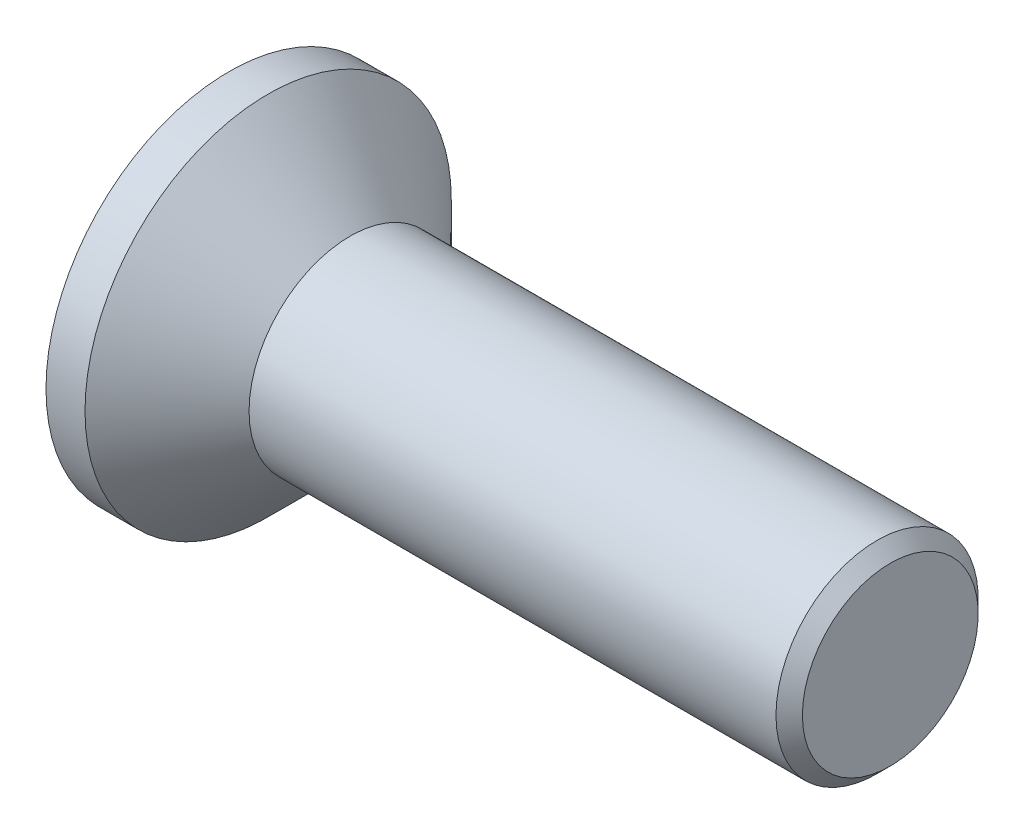
ISO-10303-21;
HEADER;
FILE_DESCRIPTION(('STEP AP214'),'2;1');
FILE_NAME('part.step','',(''),(''),'','','');
FILE_SCHEMA(('AUTOMOTIVE_DESIGN { 1 0 10303 214 1 1 1 1 }'));
ENDSEC;
DATA;
#1=APPLICATION_CONTEXT('core data for automotive mechanical design processes');
#2=APPLICATION_PROTOCOL_DEFINITION('international standard','automotive_design',2000,#1);
#3=PRODUCT_CONTEXT('',#1,'mechanical');
#4=PRODUCT('Part','Part','',(#3));
#5=PRODUCT_RELATED_PRODUCT_CATEGORY('part','',(#4));
#6=PRODUCT_DEFINITION_FORMATION('','',#4);
#7=PRODUCT_DEFINITION_CONTEXT('part definition',#1,'design');
#8=PRODUCT_DEFINITION('design','',#6,#7);
#9=PRODUCT_DEFINITION_SHAPE('','',#8);
#10=(LENGTH_UNIT() NAMED_UNIT(*) SI_UNIT(.MILLI.,.METRE.));
#11=(NAMED_UNIT(*) PLANE_ANGLE_UNIT() SI_UNIT($,.RADIAN.));
#12=(NAMED_UNIT(*) SI_UNIT($,.STERADIAN.) SOLID_ANGLE_UNIT());
#13=UNCERTAINTY_MEASURE_WITH_UNIT(LENGTH_MEASURE(1.E-05),#10,'distance_accuracy_value','');
#14=(GEOMETRIC_REPRESENTATION_CONTEXT(3) GLOBAL_UNCERTAINTY_ASSIGNED_CONTEXT((#13)) GLOBAL_UNIT_ASSIGNED_CONTEXT((#10,
#11,#12)) REPRESENTATION_CONTEXT('',''));
#15=CARTESIAN_POINT('',(0.,0.,0.));
#16=DIRECTION('',(0.,0.,1.));
#17=DIRECTION('',(1.,0.,0.));
#18=AXIS2_PLACEMENT_3D('',#15,#16,#17);
#19=CARTESIAN_POINT('',(1.09999999999999,0.,0.));
#20=DIRECTION('',(-1.,0.,0.));
#21=DIRECTION('',(0.,0.,1.));
#22=AXIS2_PLACEMENT_3D('',#19,#20,#21);
#23=CONICAL_SURFACE('',#22,0.99999999999989,1.04719755119658);
#24=CARTESIAN_POINT('',(1.67735026918958,0.,0.));
#25=VERTEX_POINT('',#24);
#26=VERTEX_LOOP('',#25);
#27=FACE_BOUND('',#26,.T.);
#28=CARTESIAN_POINT('',(1.09999999999999,0.,0.));
#29=DIRECTION('',(-1.,0.,0.));
#30=DIRECTION('',(0.,0.,1.));
#31=AXIS2_PLACEMENT_3D('',#28,#29,#30);
#32=CIRCLE('',#31,0.99999999999989);
#33=CARTESIAN_POINT('',(1.09999999999999,-0.499999999999972,0.86602540378439));
#34=VERTEX_POINT('',#33);
#35=CARTESIAN_POINT('',(1.09999999999999,0.499999999999972,0.866025403784391));
#36=VERTEX_POINT('',#35);
#37=EDGE_CURVE('E92',#34,#36,#32,.T.);
#38=ORIENTED_EDGE('',*,*,#37,.T.);
#39=CARTESIAN_POINT('',(1.09999999999999,0.,0.));
#40=DIRECTION('',(-1.,0.,0.));
#41=DIRECTION('',(0.,0.,1.));
#42=AXIS2_PLACEMENT_3D('',#39,#40,#41);
#43=CIRCLE('',#42,0.99999999999989);
#44=CARTESIAN_POINT('',(1.09999999999999,0.999999999999945,0.));
#45=VERTEX_POINT('',#44);
#46=EDGE_CURVE('E106',#36,#45,#43,.T.);
#47=ORIENTED_EDGE('',*,*,#46,.T.);
#48=CARTESIAN_POINT('',(1.09999999999999,0.,0.));
#49=DIRECTION('',(-1.,0.,0.));
#50=DIRECTION('',(0.,0.,1.));
#51=AXIS2_PLACEMENT_3D('',#48,#49,#50);
#52=CIRCLE('',#51,0.99999999999989);
#53=CARTESIAN_POINT('',(1.09999999999999,0.499999999999972,-0.866025403784391));
#54=VERTEX_POINT('',#53);
#55=EDGE_CURVE('E149',#45,#54,#52,.T.);
#56=ORIENTED_EDGE('',*,*,#55,.T.);
#57=CARTESIAN_POINT('',(1.09999999999999,0.,0.));
#58=DIRECTION('',(-1.,0.,0.));
#59=DIRECTION('',(0.,0.,1.));
#60=AXIS2_PLACEMENT_3D('',#57,#58,#59);
#61=CIRCLE('',#60,0.99999999999989);
#62=CARTESIAN_POINT('',(1.09999999999999,-0.499999999999973,-0.866025403784392));
#63=VERTEX_POINT('',#62);
#64=EDGE_CURVE('E136',#54,#63,#61,.T.);
#65=ORIENTED_EDGE('',*,*,#64,.T.);
#66=CARTESIAN_POINT('',(1.09999999999999,0.,0.));
#67=DIRECTION('',(-1.,0.,0.));
#68=DIRECTION('',(0.,0.,1.));
#69=AXIS2_PLACEMENT_3D('',#66,#67,#68);
#70=CIRCLE('',#69,0.99999999999989);
#71=CARTESIAN_POINT('',(1.09999999999999,-0.999999999999945,0.));
#72=VERTEX_POINT('',#71);
#73=EDGE_CURVE('E89',#63,#72,#70,.T.);
#74=ORIENTED_EDGE('',*,*,#73,.T.);
#75=CARTESIAN_POINT('',(1.09999999999999,0.,0.));
#76=DIRECTION('',(-1.,0.,0.));
#77=DIRECTION('',(0.,0.,1.));
#78=AXIS2_PLACEMENT_3D('',#75,#76,#77);
#79=CIRCLE('',#78,0.99999999999989);
#80=EDGE_CURVE('E20',#72,#34,#79,.T.);
#81=ORIENTED_EDGE('',*,*,#80,.T.);
#82=EDGE_LOOP('',(#38,#47,#56,#65,#74,#81));
#83=FACE_BOUND('',#82,.T.);
#84=ADVANCED_FACE('F17',(#27,#83),#23,.F.);
#85=CARTESIAN_POINT('',(1.1,0.,-1.15470053837925));
#86=DIRECTION('',(1.,0.,0.));
#87=DIRECTION('',(0.,0.,-1.));
#88=AXIS2_PLACEMENT_3D('',#85,#86,#87);
#89=PLANE('',#88);
#90=DIRECTION('',(0.,0.,1.));
#91=VECTOR('',#90,1.);
#92=CARTESIAN_POINT('',(1.1,-1.,0.577350269189625));
#93=LINE('',#92,#91);
#94=CARTESIAN_POINT('',(1.1,-1.,0.577350269189624));
#95=VERTEX_POINT('',#94);
#96=EDGE_CURVE('E111',#95,#72,#93,.F.);
#97=ORIENTED_EDGE('',*,*,#96,.F.);
#98=DIRECTION('',(0.,0.866025403784439,0.5));
#99=VECTOR('',#98,1.);
#100=CARTESIAN_POINT('',(1.1,0.,1.15470053837925));
#101=LINE('',#100,#99);
#102=EDGE_CURVE('E108',#34,#95,#101,.F.);
#103=ORIENTED_EDGE('',*,*,#102,.F.);
#104=ORIENTED_EDGE('',*,*,#80,.F.);
#105=EDGE_LOOP('',(#97,#103,#104));
#106=FACE_BOUND('',#105,.T.);
#107=ADVANCED_FACE('F109',(#106),#89,.F.);
#108=CARTESIAN_POINT('',(1.1,0.,-1.15470053837925));
#109=DIRECTION('',(1.,0.,0.));
#110=DIRECTION('',(0.,0.,-1.));
#111=AXIS2_PLACEMENT_3D('',#108,#109,#110);
#112=PLANE('',#111);
#113=DIRECTION('',(0.,0.866025403784439,0.5));
#114=VECTOR('',#113,1.);
#115=CARTESIAN_POINT('',(1.1,0.,1.15470053837925));
#116=LINE('',#115,#114);
#117=CARTESIAN_POINT('',(1.1,0.,1.15470053837925));
#118=VERTEX_POINT('',#117);
#119=EDGE_CURVE('E101',#118,#34,#116,.F.);
#120=ORIENTED_EDGE('',*,*,#119,.F.);
#121=DIRECTION('',(0.,0.866025403784439,-0.5));
#122=VECTOR('',#121,1.);
#123=CARTESIAN_POINT('',(1.1,1.,0.577350269189625));
#124=LINE('',#123,#122);
#125=EDGE_CURVE('E104',#36,#118,#124,.F.);
#126=ORIENTED_EDGE('',*,*,#125,.F.);
#127=ORIENTED_EDGE('',*,*,#37,.F.);
#128=EDGE_LOOP('',(#120,#126,#127));
#129=FACE_BOUND('',#128,.T.);
#130=ADVANCED_FACE('F99',(#129),#112,.F.);
#131=CARTESIAN_POINT('',(1.1,0.,-1.15470053837925));
#132=DIRECTION('',(1.,0.,0.));
#133=DIRECTION('',(0.,0.,-1.));
#134=AXIS2_PLACEMENT_3D('',#131,#132,#133);
#135=PLANE('',#134);
#136=DIRECTION('',(0.,0.866025403784439,-0.5));
#137=VECTOR('',#136,1.);
#138=CARTESIAN_POINT('',(1.1,1.,0.577350269189625));
#139=LINE('',#138,#137);
#140=CARTESIAN_POINT('',(1.1,1.,0.577350269189625));
#141=VERTEX_POINT('',#140);
#142=EDGE_CURVE('E132',#141,#36,#139,.F.);
#143=ORIENTED_EDGE('',*,*,#142,.F.);
#144=DIRECTION('',(0.,0.,-1.));
#145=VECTOR('',#144,1.);
#146=CARTESIAN_POINT('',(1.1,1.,-0.577350269189625));
#147=LINE('',#146,#145);
#148=EDGE_CURVE('E165',#45,#141,#147,.F.);
#149=ORIENTED_EDGE('',*,*,#148,.F.);
#150=ORIENTED_EDGE('',*,*,#46,.F.);
#151=EDGE_LOOP('',(#143,#149,#150));
#152=FACE_BOUND('',#151,.T.);
#153=ADVANCED_FACE('F166',(#152),#135,.F.);
#154=CARTESIAN_POINT('',(1.1,0.,-1.15470053837925));
#155=DIRECTION('',(1.,0.,0.));
#156=DIRECTION('',(0.,0.,-1.));
#157=AXIS2_PLACEMENT_3D('',#154,#155,#156);
#158=PLANE('',#157);
#159=DIRECTION('',(0.,0.,-1.));
#160=VECTOR('',#159,1.);
#161=CARTESIAN_POINT('',(1.1,1.,-0.577350269189625));
#162=LINE('',#161,#160);
#163=CARTESIAN_POINT('',(1.1,1.,-0.577350269189625));
#164=VERTEX_POINT('',#163);
#165=EDGE_CURVE('E159',#164,#45,#162,.F.);
#166=ORIENTED_EDGE('',*,*,#165,.F.);
#167=DIRECTION('',(0.,-0.866025403784439,-0.5));
#168=VECTOR('',#167,1.);
#169=CARTESIAN_POINT('',(1.1,0.,-1.15470053837925));
#170=LINE('',#169,#168);
#171=EDGE_CURVE('E162',#54,#164,#170,.F.);
#172=ORIENTED_EDGE('',*,*,#171,.F.);
#173=ORIENTED_EDGE('',*,*,#55,.F.);
#174=EDGE_LOOP('',(#166,#172,#173));
#175=FACE_BOUND('',#174,.T.);
#176=ADVANCED_FACE('F157',(#175),#158,.F.);
#177=CARTESIAN_POINT('',(1.1,0.,-1.15470053837925));
#178=DIRECTION('',(1.,0.,0.));
#179=DIRECTION('',(0.,0.,-1.));
#180=AXIS2_PLACEMENT_3D('',#177,#178,#179);
#181=PLANE('',#180);
#182=DIRECTION('',(0.,-0.866025403784439,0.5));
#183=VECTOR('',#182,1.);
#184=CARTESIAN_POINT('',(1.1,-1.,-0.577350269189628));
#185=LINE('',#184,#183);
#186=CARTESIAN_POINT('',(1.1,-1.,-0.577350269189628));
#187=VERTEX_POINT('',#186);
#188=EDGE_CURVE('E211',#187,#63,#185,.F.);
#189=ORIENTED_EDGE('',*,*,#188,.F.);
#190=DIRECTION('',(0.,0.,1.));
#191=VECTOR('',#190,1.);
#192=CARTESIAN_POINT('',(1.1,-1.,0.577350269189625));
#193=LINE('',#192,#191);
#194=EDGE_CURVE('E120',#72,#187,#193,.F.);
#195=ORIENTED_EDGE('',*,*,#194,.F.);
#196=ORIENTED_EDGE('',*,*,#73,.F.);
#197=EDGE_LOOP('',(#189,#195,#196));
#198=FACE_BOUND('',#197,.T.);
#199=ADVANCED_FACE('F250',(#198),#181,.F.);
#200=CARTESIAN_POINT('',(1.1,0.,-1.15470053837925));
#201=DIRECTION('',(1.,0.,0.));
#202=DIRECTION('',(0.,0.,-1.));
#203=AXIS2_PLACEMENT_3D('',#200,#201,#202);
#204=PLANE('',#203);
#205=DIRECTION('',(0.,-0.866025403784439,-0.5));
#206=VECTOR('',#205,1.);
#207=CARTESIAN_POINT('',(1.1,0.,-1.15470053837925));
#208=LINE('',#207,#206);
#209=CARTESIAN_POINT('',(1.1,0.,-1.15470053837925));
#210=VERTEX_POINT('',#209);
#211=EDGE_CURVE('E184',#210,#54,#208,.F.);
#212=ORIENTED_EDGE('',*,*,#211,.F.);
#213=DIRECTION('',(0.,-0.866025403784439,0.5));
#214=VECTOR('',#213,1.);
#215=CARTESIAN_POINT('',(1.1,-1.,-0.577350269189628));
#216=LINE('',#215,#214);
#217=EDGE_CURVE('E214',#63,#210,#216,.F.);
#218=ORIENTED_EDGE('',*,*,#217,.F.);
#219=ORIENTED_EDGE('',*,*,#64,.F.);
#220=EDGE_LOOP('',(#212,#218,#219));
#221=FACE_BOUND('',#220,.T.);
#222=ADVANCED_FACE('F247',(#221),#204,.F.);
#223=CARTESIAN_POINT('',(1.1,-1.,0.577350269189625));
#224=DIRECTION('',(0.,1.,0.));
#225=DIRECTION('',(0.,0.,1.));
#226=AXIS2_PLACEMENT_3D('',#223,#224,#225);
#227=PLANE('',#226);
#228=ORIENTED_EDGE('',*,*,#194,.T.);
#229=DIRECTION('',(1.,0.,0.));
#230=VECTOR('',#229,1.);
#231=CARTESIAN_POINT('',(1.1,-1.,-0.577350269189628));
#232=LINE('',#231,#230);
#233=CARTESIAN_POINT('',(0.,-1.,-0.577350269189628));
#234=VERTEX_POINT('',#233);
#235=EDGE_CURVE('E215',#234,#187,#232,.T.);
#236=ORIENTED_EDGE('',*,*,#235,.F.);
#237=DIRECTION('',(0.,0.,-1.));
#238=VECTOR('',#237,1.);
#239=CARTESIAN_POINT('',(0.,-1.,0.));
#240=LINE('',#239,#238);
#241=CARTESIAN_POINT('',(0.,-1.,0.577350269189625));
#242=VERTEX_POINT('',#241);
#243=EDGE_CURVE('E210',#234,#242,#240,.F.);
#244=ORIENTED_EDGE('',*,*,#243,.T.);
#245=DIRECTION('',(1.,0.,0.));
#246=VECTOR('',#245,1.);
#247=CARTESIAN_POINT('',(1.1,-1.,0.577350269189624));
#248=LINE('',#247,#246);
#249=EDGE_CURVE('E115',#95,#242,#248,.F.);
#250=ORIENTED_EDGE('',*,*,#249,.F.);
#251=ORIENTED_EDGE('',*,*,#96,.T.);
#252=EDGE_LOOP('',(#228,#236,#244,#250,#251));
#253=FACE_BOUND('',#252,.T.);
#254=ADVANCED_FACE('F252',(#253),#227,.T.);
#255=CARTESIAN_POINT('',(1.1,0.,1.15470053837925));
#256=DIRECTION('',(0.,0.5,-0.866025403784439));
#257=DIRECTION('',(0.,0.866025403784439,0.5));
#258=AXIS2_PLACEMENT_3D('',#255,#256,#257);
#259=PLANE('',#258);
#260=ORIENTED_EDGE('',*,*,#102,.T.);
#261=ORIENTED_EDGE('',*,*,#249,.T.);
#262=DIRECTION('',(0.,0.866025403784439,0.499999999999999));
#263=VECTOR('',#262,1.);
#264=CARTESIAN_POINT('',(0.,-1.,0.577350269189625));
#265=LINE('',#264,#263);
#266=CARTESIAN_POINT('',(0.,0.,1.15470053837925));
#267=VERTEX_POINT('',#266);
#268=EDGE_CURVE('E205',#242,#267,#265,.T.);
#269=ORIENTED_EDGE('',*,*,#268,.T.);
#270=DIRECTION('',(1.,0.,0.));
#271=VECTOR('',#270,1.);
#272=CARTESIAN_POINT('',(1.1,0.,1.15470053837925));
#273=LINE('',#272,#271);
#274=EDGE_CURVE('E119',#118,#267,#273,.F.);
#275=ORIENTED_EDGE('',*,*,#274,.F.);
#276=ORIENTED_EDGE('',*,*,#119,.T.);
#277=EDGE_LOOP('',(#260,#261,#269,#275,#276));
#278=FACE_BOUND('',#277,.T.);
#279=ADVANCED_FACE('F117',(#278),#259,.T.);
#280=CARTESIAN_POINT('',(1.1,1.,0.577350269189625));
#281=DIRECTION('',(0.,-0.5,-0.866025403784439));
#282=DIRECTION('',(0.,0.866025403784439,-0.5));
#283=AXIS2_PLACEMENT_3D('',#280,#281,#282);
#284=PLANE('',#283);
#285=ORIENTED_EDGE('',*,*,#125,.T.);
#286=ORIENTED_EDGE('',*,*,#274,.T.);
#287=DIRECTION('',(0.,0.866025403784439,-0.5));
#288=VECTOR('',#287,1.);
#289=CARTESIAN_POINT('',(0.,0.,1.15470053837925));
#290=LINE('',#289,#288);
#291=CARTESIAN_POINT('',(0.,1.,0.577350269189625));
#292=VERTEX_POINT('',#291);
#293=EDGE_CURVE('E195',#267,#292,#290,.T.);
#294=ORIENTED_EDGE('',*,*,#293,.T.);
#295=DIRECTION('',(1.,0.,0.));
#296=VECTOR('',#295,1.);
#297=CARTESIAN_POINT('',(1.1,1.,0.577350269189625));
#298=LINE('',#297,#296);
#299=EDGE_CURVE('E170',#141,#292,#298,.F.);
#300=ORIENTED_EDGE('',*,*,#299,.F.);
#301=ORIENTED_EDGE('',*,*,#142,.T.);
#302=EDGE_LOOP('',(#285,#286,#294,#300,#301));
#303=FACE_BOUND('',#302,.T.);
#304=ADVANCED_FACE('F193',(#303),#284,.T.);
#305=CARTESIAN_POINT('',(1.1,1.,-0.577350269189625));
#306=DIRECTION('',(0.,-1.,0.));
#307=DIRECTION('',(0.,0.,-1.));
#308=AXIS2_PLACEMENT_3D('',#305,#306,#307);
#309=PLANE('',#308);
#310=ORIENTED_EDGE('',*,*,#148,.T.);
#311=ORIENTED_EDGE('',*,*,#299,.T.);
#312=DIRECTION('',(0.,0.,-1.));
#313=VECTOR('',#312,1.);
#314=CARTESIAN_POINT('',(0.,1.,0.));
#315=LINE('',#314,#313);
#316=CARTESIAN_POINT('',(0.,1.,-0.577350269189625));
#317=VERTEX_POINT('',#316);
#318=EDGE_CURVE('E197',#292,#317,#315,.T.);
#319=ORIENTED_EDGE('',*,*,#318,.T.);
#320=DIRECTION('',(1.,0.,0.));
#321=VECTOR('',#320,1.);
#322=CARTESIAN_POINT('',(1.1,1.,-0.577350269189626));
#323=LINE('',#322,#321);
#324=EDGE_CURVE('E173',#164,#317,#323,.F.);
#325=ORIENTED_EDGE('',*,*,#324,.F.);
#326=ORIENTED_EDGE('',*,*,#165,.T.);
#327=EDGE_LOOP('',(#310,#311,#319,#325,#326));
#328=FACE_BOUND('',#327,.T.);
#329=ADVANCED_FACE('F172',(#328),#309,.T.);
#330=CARTESIAN_POINT('',(1.1,0.,-1.15470053837925));
#331=DIRECTION('',(0.,-0.5,0.866025403784439));
#332=DIRECTION('',(0.,-0.866025403784439,-0.5));
#333=AXIS2_PLACEMENT_3D('',#330,#331,#332);
#334=PLANE('',#333);
#335=ORIENTED_EDGE('',*,*,#171,.T.);
#336=ORIENTED_EDGE('',*,*,#324,.T.);
#337=DIRECTION('',(0.,-0.866025403784438,-0.5));
#338=VECTOR('',#337,1.);
#339=CARTESIAN_POINT('',(0.,1.,-0.577350269189625));
#340=LINE('',#339,#338);
#341=CARTESIAN_POINT('',(0.,0.,-1.15470053837925));
#342=VERTEX_POINT('',#341);
#343=EDGE_CURVE('E35',#317,#342,#340,.T.);
#344=ORIENTED_EDGE('',*,*,#343,.T.);
#345=DIRECTION('',(1.,0.,0.));
#346=VECTOR('',#345,1.);
#347=CARTESIAN_POINT('',(1.1,0.,-1.15470053837925));
#348=LINE('',#347,#346);
#349=EDGE_CURVE('E220',#210,#342,#348,.F.);
#350=ORIENTED_EDGE('',*,*,#349,.F.);
#351=ORIENTED_EDGE('',*,*,#211,.T.);
#352=EDGE_LOOP('',(#335,#336,#344,#350,#351));
#353=FACE_BOUND('',#352,.T.);
#354=ADVANCED_FACE('F244',(#353),#334,.T.);
#355=CARTESIAN_POINT('',(1.1,-1.,-0.577350269189628));
#356=DIRECTION('',(0.,0.5,0.866025403784439));
#357=DIRECTION('',(0.,-0.866025403784439,0.5));
#358=AXIS2_PLACEMENT_3D('',#355,#356,#357);
#359=PLANE('',#358);
#360=ORIENTED_EDGE('',*,*,#217,.T.);
#361=ORIENTED_EDGE('',*,*,#349,.T.);
#362=DIRECTION('',(0.,-0.866025403784439,0.5));
#363=VECTOR('',#362,1.);
#364=CARTESIAN_POINT('',(0.,0.,-1.15470053837925));
#365=LINE('',#364,#363);
#366=EDGE_CURVE('E146',#342,#234,#365,.T.);
#367=ORIENTED_EDGE('',*,*,#366,.T.);
#368=ORIENTED_EDGE('',*,*,#235,.T.);
#369=ORIENTED_EDGE('',*,*,#188,.T.);
#370=EDGE_LOOP('',(#360,#361,#367,#368,#369));
#371=FACE_BOUND('',#370,.T.);
#372=ADVANCED_FACE('F255',(#371),#359,.T.);
#373=CARTESIAN_POINT('',(0.,0.,0.));
#374=DIRECTION('',(1.,0.,0.));
#375=DIRECTION('',(0.,0.,-1.));
#376=AXIS2_PLACEMENT_3D('',#373,#374,#375);
#377=PLANE('',#376);
#378=ORIENTED_EDGE('',*,*,#343,.F.);
#379=ORIENTED_EDGE('',*,*,#318,.F.);
#380=ORIENTED_EDGE('',*,*,#293,.F.);
#381=ORIENTED_EDGE('',*,*,#268,.F.);
#382=ORIENTED_EDGE('',*,*,#243,.F.);
#383=ORIENTED_EDGE('',*,*,#366,.F.);
#384=EDGE_LOOP('',(#378,#379,#380,#381,#382,#383));
#385=FACE_BOUND('',#384,.T.);
#386=CARTESIAN_POINT('',(0.,0.,0.));
#387=DIRECTION('',(1.,0.,0.));
#388=DIRECTION('',(0.,0.,-1.));
#389=AXIS2_PLACEMENT_3D('',#386,#387,#388);
#390=CIRCLE('',#389,2.77);
#391=CARTESIAN_POINT('',(0.,0.,-2.77));
#392=VERTEX_POINT('',#391);
#393=EDGE_CURVE('E143',#392,#392,#390,.T.);
#394=ORIENTED_EDGE('',*,*,#393,.F.);
#395=EDGE_LOOP('',(#394));
#396=FACE_BOUND('',#395,.T.);
#397=ADVANCED_FACE('F199',(#385,#396),#377,.F.);
#398=CARTESIAN_POINT('',(10.0007106781187,0.,0.));
#399=DIRECTION('',(-1.,0.,0.));
#400=DIRECTION('',(0.,0.,1.));
#401=AXIS2_PLACEMENT_3D('',#398,#399,#400);
#402=PLANE('',#401);
#403=CARTESIAN_POINT('',(10.0007106781845,0.,0.));
#404=DIRECTION('',(-1.,0.,0.));
#405=DIRECTION('',(0.,0.,1.));
#406=AXIS2_PLACEMENT_3D('',#403,#404,#405);
#407=CIRCLE('',#406,1.32928932191589);
#408=CARTESIAN_POINT('',(10.0007106781845,0.,1.32928932191589));
#409=VERTEX_POINT('',#408);
#410=EDGE_CURVE('E139',#409,#409,#407,.T.);
#411=ORIENTED_EDGE('',*,*,#410,.F.);
#412=EDGE_LOOP('',(#411));
#413=FACE_BOUND('',#412,.T.);
#414=ADVANCED_FACE('F263',(#413),#402,.F.);
#415=CARTESIAN_POINT('',(11.8531386861314,0.,0.));
#416=DIRECTION('',(1.,0.,0.));
#417=DIRECTION('',(0.,0.,-1.));
#418=AXIS2_PLACEMENT_3D('',#415,#416,#417);
#419=CYLINDRICAL_SURFACE('',#418,2.77);
#420=CARTESIAN_POINT('',(0.589999999988322,0.,0.));
#421=DIRECTION('',(-1.,0.,0.));
#422=DIRECTION('',(0.,0.,-1.));
#423=AXIS2_PLACEMENT_3D('',#420,#421,#422);
#424=CIRCLE('',#423,2.77000000005501);
#425=CARTESIAN_POINT('',(0.589999999988322,0.,-2.77000000005501));
#426=VERTEX_POINT('',#425);
#427=EDGE_CURVE('E142',#426,#426,#424,.F.);
#428=ORIENTED_EDGE('',*,*,#427,.F.);
#429=EDGE_LOOP('',(#428));
#430=FACE_BOUND('',#429,.T.);
#431=ORIENTED_EDGE('',*,*,#393,.T.);
#432=EDGE_LOOP('',(#431));
#433=FACE_BOUND('',#432,.T.);
#434=ADVANCED_FACE('F281',(#430,#433),#419,.T.);
#435=CARTESIAN_POINT('',(9.80071067817789,0.,0.));
#436=DIRECTION('',(-1.,0.,0.));
#437=DIRECTION('',(0.,0.,1.));
#438=AXIS2_PLACEMENT_3D('',#435,#436,#437);
#439=CONICAL_SURFACE('',#438,1.52928932186569,0.78539816325534);
#440=CARTESIAN_POINT('',(9.80071067811865,0.,0.));
#441=DIRECTION('',(-1.,0.,0.));
#442=DIRECTION('',(0.,0.,1.));
#443=AXIS2_PLACEMENT_3D('',#440,#441,#442);
#444=CIRCLE('',#443,1.52928932188135);
#445=CARTESIAN_POINT('',(9.80071067811865,0.,1.52928932188135));
#446=VERTEX_POINT('',#445);
#447=EDGE_CURVE('E26',#446,#446,#444,.T.);
#448=ORIENTED_EDGE('',*,*,#447,.F.);
#449=EDGE_LOOP('',(#448));
#450=FACE_BOUND('',#449,.T.);
#451=ORIENTED_EDGE('',*,*,#410,.T.);
#452=EDGE_LOOP('',(#451));
#453=FACE_BOUND('',#452,.T.);
#454=ADVANCED_FACE('F274',(#450,#453),#439,.T.);
#455=CARTESIAN_POINT('',(0.589999999931479,0.,0.));
#456=DIRECTION('',(-1.,0.,0.));
#457=DIRECTION('',(0.,0.,1.));
#458=AXIS2_PLACEMENT_3D('',#455,#456,#457);
#459=CONICAL_SURFACE('',#458,2.77000000011185,0.785398163397448);
#460=ORIENTED_EDGE('',*,*,#427,.T.);
#461=EDGE_LOOP('',(#460));
#462=FACE_BOUND('',#461,.T.);
#463=CARTESIAN_POINT('',(1.83071067811866,0.,0.));
#464=DIRECTION('',(-1.,0.,0.));
#465=DIRECTION('',(0.,0.,1.));
#466=AXIS2_PLACEMENT_3D('',#463,#464,#465);
#467=CIRCLE('',#466,1.52928932188135);
#468=CARTESIAN_POINT('',(1.83071067811866,0.,1.52928932188135));
#469=VERTEX_POINT('',#468);
#470=EDGE_CURVE('E10',#469,#469,#467,.F.);
#471=ORIENTED_EDGE('',*,*,#470,.F.);
#472=EDGE_LOOP('',(#471));
#473=FACE_BOUND('',#472,.T.);
#474=ADVANCED_FACE('F268',(#462,#473),#459,.T.);
#475=CARTESIAN_POINT('',(10.0007106781187,0.,0.));
#476=DIRECTION('',(-1.,0.,0.));
#477=DIRECTION('',(0.,0.,1.));
#478=AXIS2_PLACEMENT_3D('',#475,#476,#477);
#479=CYLINDRICAL_SURFACE('',#478,1.52928932188135);
#480=ORIENTED_EDGE('',*,*,#470,.T.);
#481=EDGE_LOOP('',(#480));
#482=FACE_BOUND('',#481,.T.);
#483=ORIENTED_EDGE('',*,*,#447,.T.);
#484=EDGE_LOOP('',(#483));
#485=FACE_BOUND('',#484,.T.);
#486=ADVANCED_FACE('F266',(#482,#485),#479,.T.);
#487=CLOSED_SHELL('',(#84,#107,#130,#153,#176,#199,#222,#254,#279,#304,#329,#354,#372,#397,#414,
#434,#454,#474,#486));
#488=MANIFOLD_SOLID_BREP('B1',#487);
#489=ADVANCED_BREP_SHAPE_REPRESENTATION('',(#18,#488),#14);
#490=SHAPE_DEFINITION_REPRESENTATION(#9,#489);
ENDSEC;
END-ISO-10303-21;
